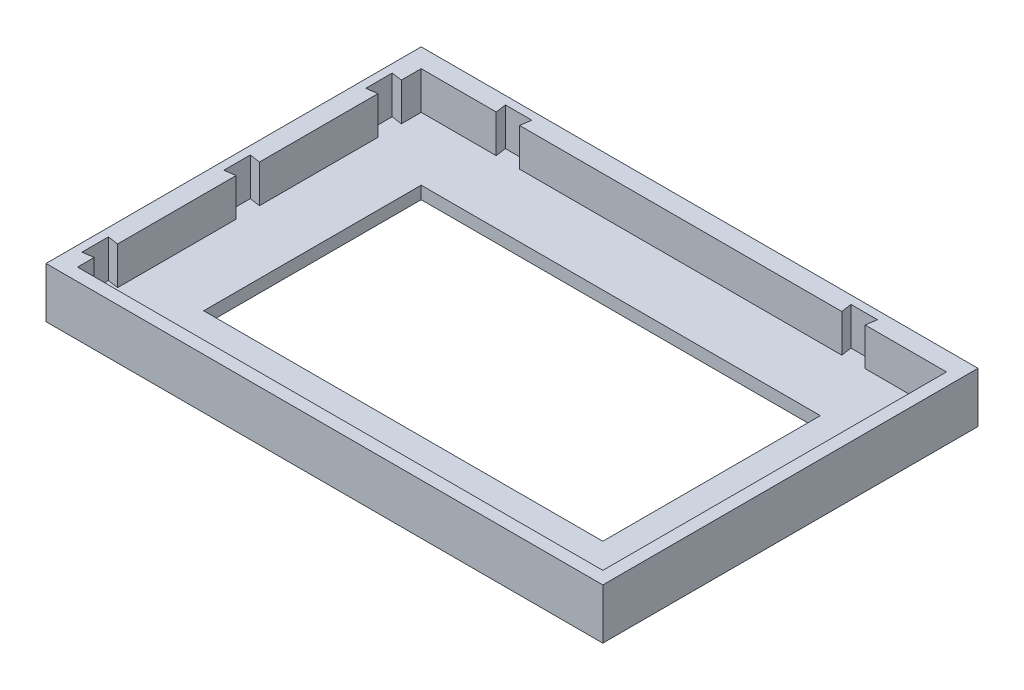
ISO-10303-21;
HEADER;
FILE_DESCRIPTION(('STEP AP214'),'2;1');
FILE_NAME('part.step','',(''),(''),'','','');
FILE_SCHEMA(('AUTOMOTIVE_DESIGN { 1 0 10303 214 1 1 1 1 }'));
ENDSEC;
DATA;
#1=APPLICATION_CONTEXT('core data for automotive mechanical design processes');
#2=APPLICATION_PROTOCOL_DEFINITION('international standard','automotive_design',2000,#1);
#3=PRODUCT_CONTEXT('',#1,'mechanical');
#4=PRODUCT('Part','Part','',(#3));
#5=PRODUCT_RELATED_PRODUCT_CATEGORY('part','',(#4));
#6=PRODUCT_DEFINITION_FORMATION('','',#4);
#7=PRODUCT_DEFINITION_CONTEXT('part definition',#1,'design');
#8=PRODUCT_DEFINITION('design','',#6,#7);
#9=PRODUCT_DEFINITION_SHAPE('','',#8);
#10=(LENGTH_UNIT() NAMED_UNIT(*) SI_UNIT(.MILLI.,.METRE.));
#11=(NAMED_UNIT(*) PLANE_ANGLE_UNIT() SI_UNIT($,.RADIAN.));
#12=(NAMED_UNIT(*) SI_UNIT($,.STERADIAN.) SOLID_ANGLE_UNIT());
#13=UNCERTAINTY_MEASURE_WITH_UNIT(LENGTH_MEASURE(1.E-05),#10,'distance_accuracy_value','');
#14=(GEOMETRIC_REPRESENTATION_CONTEXT(3) GLOBAL_UNCERTAINTY_ASSIGNED_CONTEXT((#13)) GLOBAL_UNIT_ASSIGNED_CONTEXT((#10,
#11,#12)) REPRESENTATION_CONTEXT('',''));
#15=CARTESIAN_POINT('',(0.,0.,0.));
#16=DIRECTION('',(0.,0.,1.));
#17=DIRECTION('',(1.,0.,0.));
#18=AXIS2_PLACEMENT_3D('',#15,#16,#17);
#19=CARTESIAN_POINT('',(-35.2233281216379,-99.5446633426423,-22.4535939570029));
#20=DIRECTION('',(0.,0.,-1.));
#21=DIRECTION('',(-1.,0.,0.));
#22=AXIS2_PLACEMENT_3D('',#19,#20,#21);
#23=PLANE('',#22);
#24=DIRECTION('',(-1.,0.,0.));
#25=VECTOR('',#24,1.);
#26=CARTESIAN_POINT('',(-35.2233281216379,2.,-22.4535939570029));
#27=LINE('',#26,#25);
#28=CARTESIAN_POINT('',(31.4766718783621,2.,-22.4535939570029));
#29=VERTEX_POINT('',#28);
#30=CARTESIAN_POINT('',(-19.6233281216379,2.,-22.4535939570029));
#31=VERTEX_POINT('',#30);
#32=EDGE_CURVE('E520',#29,#31,#27,.T.);
#33=ORIENTED_EDGE('',*,*,#32,.F.);
#34=DIRECTION('',(0.,1.,0.));
#35=VECTOR('',#34,1.);
#36=CARTESIAN_POINT('',(31.4766718783621,-2.53100430368368,-22.4535939570029));
#37=LINE('',#36,#35);
#38=CARTESIAN_POINT('',(31.4766718783621,8.,-22.4535939570029));
#39=VERTEX_POINT('',#38);
#40=EDGE_CURVE('E388',#29,#39,#37,.T.);
#41=ORIENTED_EDGE('',*,*,#40,.T.);
#42=DIRECTION('',(-1.,0.,0.));
#43=VECTOR('',#42,1.);
#44=CARTESIAN_POINT('',(-35.2233281216379,8.,-22.4535939570029));
#45=LINE('',#44,#43);
#46=CARTESIAN_POINT('',(-19.6233281216379,8.,-22.4535939570029));
#47=VERTEX_POINT('',#46);
#48=EDGE_CURVE('E489',#39,#47,#45,.T.);
#49=ORIENTED_EDGE('',*,*,#48,.T.);
#50=DIRECTION('',(0.,1.,0.));
#51=VECTOR('',#50,1.);
#52=CARTESIAN_POINT('',(-19.6233281216379,-2.53100430368368,-22.4535939570029));
#53=LINE('',#52,#51);
#54=EDGE_CURVE('E428',#31,#47,#53,.T.);
#55=ORIENTED_EDGE('',*,*,#54,.F.);
#56=EDGE_LOOP('',(#33,#41,#49,#55));
#57=FACE_BOUND('',#56,.T.);
#58=ADVANCED_FACE('F45',(#57),#23,.F.);
#59=CARTESIAN_POINT('',(-23.3233281216379,2.,-22.4535939570029));
#60=VERTEX_POINT('',#59);
#61=CARTESIAN_POINT('',(-35.2233281216379,2.,-22.4535939570029));
#62=VERTEX_POINT('',#61);
#63=EDGE_CURVE('E521',#60,#62,#27,.T.);
#64=ORIENTED_EDGE('',*,*,#63,.F.);
#65=DIRECTION('',(0.,1.,0.));
#66=VECTOR('',#65,1.);
#67=CARTESIAN_POINT('',(-23.3233281216379,-2.53100430368368,-22.4535939570029));
#68=LINE('',#67,#66);
#69=CARTESIAN_POINT('',(-23.3233281216379,8.,-22.4535939570029));
#70=VERTEX_POINT('',#69);
#71=EDGE_CURVE('E424',#60,#70,#68,.T.);
#72=ORIENTED_EDGE('',*,*,#71,.T.);
#73=CARTESIAN_POINT('',(-35.2233281216379,8.,-22.4535939570029));
#74=VERTEX_POINT('',#73);
#75=EDGE_CURVE('E490',#70,#74,#45,.T.);
#76=ORIENTED_EDGE('',*,*,#75,.T.);
#77=DIRECTION('',(0.,1.,0.));
#78=VECTOR('',#77,1.);
#79=CARTESIAN_POINT('',(-35.2233281216379,-99.5446633426423,-22.4535939570029));
#80=LINE('',#79,#78);
#81=EDGE_CURVE('E519',#62,#74,#80,.T.);
#82=ORIENTED_EDGE('',*,*,#81,.F.);
#83=EDGE_LOOP('',(#64,#72,#76,#82));
#84=FACE_BOUND('',#83,.T.);
#85=ADVANCED_FACE('F599',(#84),#23,.F.);
#86=CARTESIAN_POINT('',(-35.2233281216379,-99.5446633426423,32.0464060429971));
#87=DIRECTION('',(-1.,0.,0.));
#88=DIRECTION('',(0.,0.,1.));
#89=AXIS2_PLACEMENT_3D('',#86,#87,#88);
#90=PLANE('',#89);
#91=DIRECTION('',(0.,0.,1.));
#92=VECTOR('',#91,1.);
#93=CARTESIAN_POINT('',(-35.2233281216379,8.,32.0464060429971));
#94=LINE('',#93,#92);
#95=CARTESIAN_POINT('',(-35.2233281216379,8.,6.8964060429971));
#96=VERTEX_POINT('',#95);
#97=CARTESIAN_POINT('',(-35.2233281216379,8.,25.6964060429971));
#98=VERTEX_POINT('',#97);
#99=EDGE_CURVE('E645',#96,#98,#94,.T.);
#100=ORIENTED_EDGE('',*,*,#99,.T.);
#101=DIRECTION('',(0.,1.,0.));
#102=VECTOR('',#101,1.);
#103=CARTESIAN_POINT('',(-35.2233281216379,-2.53100430368368,25.6964060429971));
#104=LINE('',#103,#102);
#105=CARTESIAN_POINT('',(-35.2233281216379,2.,25.6964060429971));
#106=VERTEX_POINT('',#105);
#107=EDGE_CURVE('E334',#106,#98,#104,.T.);
#108=ORIENTED_EDGE('',*,*,#107,.F.);
#109=DIRECTION('',(0.,0.,1.));
#110=VECTOR('',#109,1.);
#111=CARTESIAN_POINT('',(-35.2233281216379,2.,32.0464060429971));
#112=LINE('',#111,#110);
#113=CARTESIAN_POINT('',(-35.223328121638,2.,6.89640604299711));
#114=VERTEX_POINT('',#113);
#115=EDGE_CURVE('E666',#114,#106,#112,.T.);
#116=ORIENTED_EDGE('',*,*,#115,.F.);
#117=DIRECTION('',(0.,1.,0.));
#118=VECTOR('',#117,1.);
#119=CARTESIAN_POINT('',(-35.223328121638,-2.53100430368368,6.89640604299711));
#120=LINE('',#119,#118);
#121=EDGE_CURVE('E452',#114,#96,#120,.T.);
#122=ORIENTED_EDGE('',*,*,#121,.T.);
#123=EDGE_LOOP('',(#100,#108,#116,#122));
#124=FACE_BOUND('',#123,.T.);
#125=ADVANCED_FACE('F606',(#124),#90,.F.);
#126=CARTESIAN_POINT('',(-35.2233281216381,8.,-19.3035939570029));
#127=VERTEX_POINT('',#126);
#128=EDGE_CURVE('E499',#74,#127,#94,.T.);
#129=ORIENTED_EDGE('',*,*,#128,.T.);
#130=DIRECTION('',(0.,1.,0.));
#131=VECTOR('',#130,1.);
#132=CARTESIAN_POINT('',(-35.2233281216381,-2.53100430368368,-19.3035939570029));
#133=LINE('',#132,#131);
#134=CARTESIAN_POINT('',(-35.2233281216381,2.,-19.3035939570029));
#135=VERTEX_POINT('',#134);
#136=EDGE_CURVE('E342',#135,#127,#133,.T.);
#137=ORIENTED_EDGE('',*,*,#136,.F.);
#138=EDGE_CURVE('E508',#62,#135,#112,.T.);
#139=ORIENTED_EDGE('',*,*,#138,.F.);
#140=ORIENTED_EDGE('',*,*,#81,.T.);
#141=EDGE_LOOP('',(#129,#137,#139,#140));
#142=FACE_BOUND('',#141,.T.);
#143=ADVANCED_FACE('F926',(#142),#90,.F.);
#144=CARTESIAN_POINT('',(-35.2233281216381,2.,-15.6035939570029));
#145=VERTEX_POINT('',#144);
#146=CARTESIAN_POINT('',(-35.223328121638,2.,3.1964060429971));
#147=VERTEX_POINT('',#146);
#148=EDGE_CURVE('E513',#145,#147,#112,.T.);
#149=ORIENTED_EDGE('',*,*,#148,.F.);
#150=DIRECTION('',(0.,1.,0.));
#151=VECTOR('',#150,1.);
#152=CARTESIAN_POINT('',(-35.2233281216381,-2.53100430368368,-15.6035939570029));
#153=LINE('',#152,#151);
#154=CARTESIAN_POINT('',(-35.2233281216379,8.,-15.6035939570029));
#155=VERTEX_POINT('',#154);
#156=EDGE_CURVE('E345',#145,#155,#153,.T.);
#157=ORIENTED_EDGE('',*,*,#156,.T.);
#158=CARTESIAN_POINT('',(-35.223328121638,8.,3.1964060429971));
#159=VERTEX_POINT('',#158);
#160=EDGE_CURVE('E503',#155,#159,#94,.T.);
#161=ORIENTED_EDGE('',*,*,#160,.T.);
#162=DIRECTION('',(0.,1.,0.));
#163=VECTOR('',#162,1.);
#164=CARTESIAN_POINT('',(-35.223328121638,-2.53100430368368,3.1964060429971));
#165=LINE('',#164,#163);
#166=EDGE_CURVE('E373',#147,#159,#165,.T.);
#167=ORIENTED_EDGE('',*,*,#166,.F.);
#168=EDGE_LOOP('',(#149,#157,#161,#167));
#169=FACE_BOUND('',#168,.T.);
#170=ADVANCED_FACE('F597',(#169),#90,.F.);
#171=CARTESIAN_POINT('',(-38.2233281216379,8.,34.0464060429971));
#172=DIRECTION('',(1.,0.,0.));
#173=DIRECTION('',(0.,0.,-1.));
#174=AXIS2_PLACEMENT_3D('',#171,#172,#173);
#175=PLANE('',#174);
#176=DIRECTION('',(0.,0.,1.));
#177=VECTOR('',#176,1.);
#178=CARTESIAN_POINT('',(-38.2233281216379,0.,34.0464060429971));
#179=LINE('',#178,#177);
#180=CARTESIAN_POINT('',(-38.2233281216379,0.,-25.4535939570029));
#181=VERTEX_POINT('',#180);
#182=CARTESIAN_POINT('',(-38.2233281216379,0.,34.0464060429971));
#183=VERTEX_POINT('',#182);
#184=EDGE_CURVE('E537',#181,#183,#179,.T.);
#185=ORIENTED_EDGE('',*,*,#184,.T.);
#186=DIRECTION('',(0.,-1.,0.));
#187=VECTOR('',#186,1.);
#188=CARTESIAN_POINT('',(-38.2233281216379,8.,34.0464060429971));
#189=LINE('',#188,#187);
#190=CARTESIAN_POINT('',(-38.2233281216379,8.,34.0464060429971));
#191=VERTEX_POINT('',#190);
#192=EDGE_CURVE('E12',#191,#183,#189,.T.);
#193=ORIENTED_EDGE('',*,*,#192,.F.);
#194=DIRECTION('',(0.,0.,1.));
#195=VECTOR('',#194,1.);
#196=CARTESIAN_POINT('',(-38.2233281216379,8.,34.0464060429971));
#197=LINE('',#196,#195);
#198=CARTESIAN_POINT('',(-38.2233281216379,8.,-25.4535939570029));
#199=VERTEX_POINT('',#198);
#200=EDGE_CURVE('E538',#199,#191,#197,.T.);
#201=ORIENTED_EDGE('',*,*,#200,.F.);
#202=DIRECTION('',(0.,-1.,0.));
#203=VECTOR('',#202,1.);
#204=CARTESIAN_POINT('',(-38.2233281216379,8.,-25.4535939570029));
#205=LINE('',#204,#203);
#206=EDGE_CURVE('E552',#199,#181,#205,.T.);
#207=ORIENTED_EDGE('',*,*,#206,.T.);
#208=EDGE_LOOP('',(#185,#193,#201,#207));
#209=FACE_BOUND('',#208,.T.);
#210=ADVANCED_FACE('F47',(#209),#175,.F.);
#211=CARTESIAN_POINT('',(-38.2233281216379,8.,34.0464060429971));
#212=DIRECTION('',(0.,0.,-1.));
#213=DIRECTION('',(-1.,0.,0.));
#214=AXIS2_PLACEMENT_3D('',#211,#212,#213);
#215=PLANE('',#214);
#216=DIRECTION('',(1.,0.,0.));
#217=VECTOR('',#216,1.);
#218=CARTESIAN_POINT('',(-38.2233281216379,0.,34.0464060429971));
#219=LINE('',#218,#217);
#220=CARTESIAN_POINT('',(50.0766718783621,0.,34.0464060429971));
#221=VERTEX_POINT('',#220);
#222=EDGE_CURVE('E556',#183,#221,#219,.T.);
#223=ORIENTED_EDGE('',*,*,#222,.T.);
#224=DIRECTION('',(0.,-1.,0.));
#225=VECTOR('',#224,1.);
#226=CARTESIAN_POINT('',(50.0766718783621,8.,34.0464060429971));
#227=LINE('',#226,#225);
#228=CARTESIAN_POINT('',(50.0766718783621,8.,34.0464060429971));
#229=VERTEX_POINT('',#228);
#230=EDGE_CURVE('E54',#229,#221,#227,.T.);
#231=ORIENTED_EDGE('',*,*,#230,.F.);
#232=DIRECTION('',(1.,0.,0.));
#233=VECTOR('',#232,1.);
#234=CARTESIAN_POINT('',(-38.2233281216379,8.,34.0464060429971));
#235=LINE('',#234,#233);
#236=EDGE_CURVE('E542',#191,#229,#235,.T.);
#237=ORIENTED_EDGE('',*,*,#236,.F.);
#238=ORIENTED_EDGE('',*,*,#192,.T.);
#239=EDGE_LOOP('',(#223,#231,#237,#238));
#240=FACE_BOUND('',#239,.T.);
#241=ADVANCED_FACE('F590',(#240),#215,.F.);
#242=CARTESIAN_POINT('',(50.0766718783621,8.,34.0464060429971));
#243=DIRECTION('',(-1.,0.,0.));
#244=DIRECTION('',(0.,0.,1.));
#245=AXIS2_PLACEMENT_3D('',#242,#243,#244);
#246=PLANE('',#245);
#247=DIRECTION('',(0.,0.,-1.));
#248=VECTOR('',#247,1.);
#249=CARTESIAN_POINT('',(50.0766718783621,0.,34.0464060429971));
#250=LINE('',#249,#248);
#251=CARTESIAN_POINT('',(50.0766718783621,0.,-25.4535939570029));
#252=VERTEX_POINT('',#251);
#253=EDGE_CURVE('E559',#221,#252,#250,.T.);
#254=ORIENTED_EDGE('',*,*,#253,.T.);
#255=DIRECTION('',(0.,-1.,0.));
#256=VECTOR('',#255,1.);
#257=CARTESIAN_POINT('',(50.0766718783621,8.,-25.4535939570029));
#258=LINE('',#257,#256);
#259=CARTESIAN_POINT('',(50.0766718783621,8.,-25.4535939570029));
#260=VERTEX_POINT('',#259);
#261=EDGE_CURVE('E567',#260,#252,#258,.T.);
#262=ORIENTED_EDGE('',*,*,#261,.F.);
#263=DIRECTION('',(0.,0.,-1.));
#264=VECTOR('',#263,1.);
#265=CARTESIAN_POINT('',(50.0766718783621,8.,34.0464060429971));
#266=LINE('',#265,#264);
#267=EDGE_CURVE('E546',#229,#260,#266,.T.);
#268=ORIENTED_EDGE('',*,*,#267,.F.);
#269=ORIENTED_EDGE('',*,*,#230,.T.);
#270=EDGE_LOOP('',(#254,#262,#268,#269));
#271=FACE_BOUND('',#270,.T.);
#272=ADVANCED_FACE('F576',(#271),#246,.F.);
#273=CARTESIAN_POINT('',(-38.2233281216379,8.,-25.4535939570029));
#274=DIRECTION('',(0.,0.,1.));
#275=DIRECTION('',(1.,0.,0.));
#276=AXIS2_PLACEMENT_3D('',#273,#274,#275);
#277=PLANE('',#276);
#278=DIRECTION('',(-1.,0.,0.));
#279=VECTOR('',#278,1.);
#280=CARTESIAN_POINT('',(-38.2233281216379,0.,-25.4535939570029));
#281=LINE('',#280,#279);
#282=EDGE_CURVE('E543',#252,#181,#281,.T.);
#283=ORIENTED_EDGE('',*,*,#282,.T.);
#284=ORIENTED_EDGE('',*,*,#206,.F.);
#285=DIRECTION('',(-1.,0.,0.));
#286=VECTOR('',#285,1.);
#287=CARTESIAN_POINT('',(-38.2233281216379,8.,-25.4535939570029));
#288=LINE('',#287,#286);
#289=EDGE_CURVE('E549',#260,#199,#288,.T.);
#290=ORIENTED_EDGE('',*,*,#289,.F.);
#291=ORIENTED_EDGE('',*,*,#261,.T.);
#292=EDGE_LOOP('',(#283,#284,#290,#291));
#293=FACE_BOUND('',#292,.T.);
#294=ADVANCED_FACE('F583',(#293),#277,.F.);
#295=CARTESIAN_POINT('',(0.,8.,0.));
#296=DIRECTION('',(0.,-1.,0.));
#297=DIRECTION('',(0.,0.,-1.));
#298=AXIS2_PLACEMENT_3D('',#295,#296,#297);
#299=PLANE('',#298);
#300=DIRECTION('',(0.,0.,1.));
#301=VECTOR('',#300,1.);
#302=CARTESIAN_POINT('',(-36.9233281216379,8.,29.6464060429971));
#303=LINE('',#302,#301);
#304=CARTESIAN_POINT('',(-36.9233281216379,8.,25.4464060429971));
#305=VERTEX_POINT('',#304);
#306=CARTESIAN_POINT('',(-36.9233281216379,8.,29.6464060429971));
#307=VERTEX_POINT('',#306);
#308=EDGE_CURVE('E308',#305,#307,#303,.T.);
#309=ORIENTED_EDGE('',*,*,#308,.F.);
#310=DIRECTION('',(-0.989359135364853,0.,-0.145493990494831));
#311=VECTOR('',#310,1.);
#312=CARTESIAN_POINT('',(-36.9233281216379,8.,25.4464060429971));
#313=LINE('',#312,#311);
#314=EDGE_CURVE('E312',#98,#305,#313,.T.);
#315=ORIENTED_EDGE('',*,*,#314,.F.);
#316=ORIENTED_EDGE('',*,*,#99,.F.);
#317=DIRECTION('',(0.989359135364853,0.,-0.145493990494831));
#318=VECTOR('',#317,1.);
#319=CARTESIAN_POINT('',(-35.223328121638,8.,6.89640604299711));
#320=LINE('',#319,#318);
#321=CARTESIAN_POINT('',(-36.923328121638,8.,7.14640604299711));
#322=VERTEX_POINT('',#321);
#323=EDGE_CURVE('E474',#322,#96,#320,.T.);
#324=ORIENTED_EDGE('',*,*,#323,.F.);
#325=DIRECTION('',(0.,0.,1.));
#326=VECTOR('',#325,1.);
#327=CARTESIAN_POINT('',(-36.923328121638,8.,7.14640604299711));
#328=LINE('',#327,#326);
#329=CARTESIAN_POINT('',(-36.923328121638,8.,2.9464060429971));
#330=VERTEX_POINT('',#329);
#331=EDGE_CURVE('E478',#330,#322,#328,.T.);
#332=ORIENTED_EDGE('',*,*,#331,.F.);
#333=DIRECTION('',(-0.989359135364853,0.,-0.145493990494831));
#334=VECTOR('',#333,1.);
#335=CARTESIAN_POINT('',(-36.923328121638,8.,2.9464060429971));
#336=LINE('',#335,#334);
#337=EDGE_CURVE('E418',#159,#330,#336,.T.);
#338=ORIENTED_EDGE('',*,*,#337,.F.);
#339=ORIENTED_EDGE('',*,*,#160,.F.);
#340=DIRECTION('',(0.989359135364853,0.,-0.145493990494831));
#341=VECTOR('',#340,1.);
#342=CARTESIAN_POINT('',(-35.2233281216381,8.,-15.6035939570029));
#343=LINE('',#342,#341);
#344=CARTESIAN_POINT('',(-36.9233281216381,8.,-15.3535939570029));
#345=VERTEX_POINT('',#344);
#346=EDGE_CURVE('E368',#345,#155,#343,.T.);
#347=ORIENTED_EDGE('',*,*,#346,.F.);
#348=DIRECTION('',(0.,0.,1.));
#349=VECTOR('',#348,1.);
#350=CARTESIAN_POINT('',(-36.9233281216381,8.,-15.3535939570029));
#351=LINE('',#350,#349);
#352=CARTESIAN_POINT('',(-36.9233281216381,8.,-19.5535939570029));
#353=VERTEX_POINT('',#352);
#354=EDGE_CURVE('E374',#353,#345,#351,.T.);
#355=ORIENTED_EDGE('',*,*,#354,.F.);
#356=DIRECTION('',(-0.989359135364853,0.,-0.145493990494831));
#357=VECTOR('',#356,1.);
#358=CARTESIAN_POINT('',(-36.9233281216381,8.,-19.5535939570029));
#359=LINE('',#358,#357);
#360=EDGE_CURVE('E369',#127,#353,#359,.T.);
#361=ORIENTED_EDGE('',*,*,#360,.F.);
#362=ORIENTED_EDGE('',*,*,#128,.F.);
#363=ORIENTED_EDGE('',*,*,#75,.F.);
#364=DIRECTION('',(0.145493990494831,0.,0.989359135364853));
#365=VECTOR('',#364,1.);
#366=CARTESIAN_POINT('',(-23.3233281216379,8.,-22.4535939570029));
#367=LINE('',#366,#365);
#368=CARTESIAN_POINT('',(-23.5733281216379,8.,-24.1535939570029));
#369=VERTEX_POINT('',#368);
#370=EDGE_CURVE('E440',#369,#70,#367,.T.);
#371=ORIENTED_EDGE('',*,*,#370,.F.);
#372=DIRECTION('',(-1.,0.,0.));
#373=VECTOR('',#372,1.);
#374=CARTESIAN_POINT('',(-23.5733281216379,8.,-24.1535939570029));
#375=LINE('',#374,#373);
#376=CARTESIAN_POINT('',(-19.3733281216379,8.,-24.1535939570029));
#377=VERTEX_POINT('',#376);
#378=EDGE_CURVE('E444',#377,#369,#375,.T.);
#379=ORIENTED_EDGE('',*,*,#378,.F.);
#380=DIRECTION('',(0.145493990494831,0.,-0.989359135364853));
#381=VECTOR('',#380,1.);
#382=CARTESIAN_POINT('',(-19.3733281216379,8.,-24.1535939570029));
#383=LINE('',#382,#381);
#384=EDGE_CURVE('E316',#47,#377,#383,.T.);
#385=ORIENTED_EDGE('',*,*,#384,.F.);
#386=ORIENTED_EDGE('',*,*,#48,.F.);
#387=DIRECTION('',(0.145493990494833,0.,0.989359135364853));
#388=VECTOR('',#387,1.);
#389=CARTESIAN_POINT('',(31.4766718783621,8.,-22.4535939570029));
#390=LINE('',#389,#388);
#391=CARTESIAN_POINT('',(31.2266718783621,8.,-24.1535939570029));
#392=VERTEX_POINT('',#391);
#393=EDGE_CURVE('E404',#392,#39,#390,.T.);
#394=ORIENTED_EDGE('',*,*,#393,.F.);
#395=DIRECTION('',(-1.,0.,0.));
#396=VECTOR('',#395,1.);
#397=CARTESIAN_POINT('',(31.2266718783621,8.,-24.1535939570029));
#398=LINE('',#397,#396);
#399=CARTESIAN_POINT('',(35.4266718783621,8.,-24.1535939570029));
#400=VERTEX_POINT('',#399);
#401=EDGE_CURVE('E408',#400,#392,#398,.T.);
#402=ORIENTED_EDGE('',*,*,#401,.F.);
#403=DIRECTION('',(0.145493990494831,0.,-0.989359135364853));
#404=VECTOR('',#403,1.);
#405=CARTESIAN_POINT('',(35.4266718783621,8.,-24.1535939570029));
#406=LINE('',#405,#404);
#407=CARTESIAN_POINT('',(35.1766718783621,8.,-22.4535939570029));
#408=VERTEX_POINT('',#407);
#409=EDGE_CURVE('E346',#408,#400,#406,.T.);
#410=ORIENTED_EDGE('',*,*,#409,.F.);
#411=CARTESIAN_POINT('',(48.0766718783621,8.,-22.4535939570029));
#412=VERTEX_POINT('',#411);
#413=EDGE_CURVE('E484',#412,#408,#45,.T.);
#414=ORIENTED_EDGE('',*,*,#413,.F.);
#415=DIRECTION('',(0.,0.,-1.));
#416=VECTOR('',#415,1.);
#417=CARTESIAN_POINT('',(48.0766718783621,8.,32.0464060429971));
#418=LINE('',#417,#416);
#419=CARTESIAN_POINT('',(48.0766718783621,8.,32.0464060429971));
#420=VERTEX_POINT('',#419);
#421=EDGE_CURVE('E491',#420,#412,#418,.T.);
#422=ORIENTED_EDGE('',*,*,#421,.F.);
#423=DIRECTION('',(1.,0.,0.));
#424=VECTOR('',#423,1.);
#425=CARTESIAN_POINT('',(-35.2233281216379,8.,32.0464060429971));
#426=LINE('',#425,#424);
#427=CARTESIAN_POINT('',(-35.2233281216379,8.,32.0464060429971));
#428=VERTEX_POINT('',#427);
#429=EDGE_CURVE('E495',#428,#420,#426,.T.);
#430=ORIENTED_EDGE('',*,*,#429,.F.);
#431=CARTESIAN_POINT('',(-35.2233281216379,8.,29.3964060429971));
#432=VERTEX_POINT('',#431);
#433=EDGE_CURVE('E341',#432,#428,#94,.T.);
#434=ORIENTED_EDGE('',*,*,#433,.F.);
#435=DIRECTION('',(0.989359135364853,0.,-0.145493990494831));
#436=VECTOR('',#435,1.);
#437=CARTESIAN_POINT('',(-35.2233281216379,8.,29.3964060429971));
#438=LINE('',#437,#436);
#439=EDGE_CURVE('E304',#307,#432,#438,.T.);
#440=ORIENTED_EDGE('',*,*,#439,.F.);
#441=EDGE_LOOP('',(#309,#315,#316,#324,#332,#338,#339,#347,#355,#361,#362,#363,#371,#379,#385,
#386,#394,#402,#410,#414,#422,#430,#434,#440));
#442=FACE_BOUND('',#441,.T.);
#443=ORIENTED_EDGE('',*,*,#200,.T.);
#444=ORIENTED_EDGE('',*,*,#236,.T.);
#445=ORIENTED_EDGE('',*,*,#267,.T.);
#446=ORIENTED_EDGE('',*,*,#289,.T.);
#447=EDGE_LOOP('',(#443,#444,#445,#446));
#448=FACE_BOUND('',#447,.T.);
#449=ADVANCED_FACE('F589',(#442,#448),#299,.F.);
#450=CARTESIAN_POINT('',(0.,0.,0.));
#451=DIRECTION('',(0.,-1.,0.));
#452=DIRECTION('',(0.,0.,-1.));
#453=AXIS2_PLACEMENT_3D('',#450,#451,#452);
#454=PLANE('',#453);
#455=DIRECTION('',(0.,0.,1.));
#456=VECTOR('',#455,1.);
#457=CARTESIAN_POINT('',(-25.2233281216381,0.,22.0464060429971));
#458=LINE('',#457,#456);
#459=CARTESIAN_POINT('',(-25.2233281216381,0.,-12.4535939570029));
#460=VERTEX_POINT('',#459);
#461=CARTESIAN_POINT('',(-25.2233281216381,0.,22.0464060429971));
#462=VERTEX_POINT('',#461);
#463=EDGE_CURVE('E257',#460,#462,#458,.T.);
#464=ORIENTED_EDGE('',*,*,#463,.T.);
#465=DIRECTION('',(1.,0.,0.));
#466=VECTOR('',#465,1.);
#467=CARTESIAN_POINT('',(-25.2233281216381,0.,22.0464060429971));
#468=LINE('',#467,#466);
#469=CARTESIAN_POINT('',(38.0766718783621,0.,22.0464060429971));
#470=VERTEX_POINT('',#469);
#471=EDGE_CURVE('E267',#462,#470,#468,.T.);
#472=ORIENTED_EDGE('',*,*,#471,.T.);
#473=DIRECTION('',(0.,0.,-1.));
#474=VECTOR('',#473,1.);
#475=CARTESIAN_POINT('',(38.0766718783621,0.,22.0464060429971));
#476=LINE('',#475,#474);
#477=CARTESIAN_POINT('',(38.0766718783621,0.,-12.4535939570029));
#478=VERTEX_POINT('',#477);
#479=EDGE_CURVE('E61',#470,#478,#476,.T.);
#480=ORIENTED_EDGE('',*,*,#479,.T.);
#481=DIRECTION('',(-1.,0.,0.));
#482=VECTOR('',#481,1.);
#483=CARTESIAN_POINT('',(-25.2233281216381,0.,-12.4535939570029));
#484=LINE('',#483,#482);
#485=EDGE_CURVE('E264',#478,#460,#484,.T.);
#486=ORIENTED_EDGE('',*,*,#485,.T.);
#487=EDGE_LOOP('',(#464,#472,#480,#486));
#488=FACE_BOUND('',#487,.T.);
#489=ORIENTED_EDGE('',*,*,#184,.F.);
#490=ORIENTED_EDGE('',*,*,#282,.F.);
#491=ORIENTED_EDGE('',*,*,#253,.F.);
#492=ORIENTED_EDGE('',*,*,#222,.F.);
#493=EDGE_LOOP('',(#489,#490,#491,#492));
#494=FACE_BOUND('',#493,.T.);
#495=ADVANCED_FACE('F272',(#488,#494),#454,.T.);
#496=CARTESIAN_POINT('',(0.,2.,0.));
#497=DIRECTION('',(0.,-1.,0.));
#498=DIRECTION('',(0.,0.,-1.));
#499=AXIS2_PLACEMENT_3D('',#496,#497,#498);
#500=PLANE('',#499);
#501=DIRECTION('',(1.,0.,0.));
#502=VECTOR('',#501,1.);
#503=CARTESIAN_POINT('',(-25.2233281216381,2.,22.0464060429971));
#504=LINE('',#503,#502);
#505=CARTESIAN_POINT('',(-25.2233281216381,2.,22.0464060429971));
#506=VERTEX_POINT('',#505);
#507=CARTESIAN_POINT('',(38.0766718783621,2.,22.0464060429971));
#508=VERTEX_POINT('',#507);
#509=EDGE_CURVE('E289',#506,#508,#504,.T.);
#510=ORIENTED_EDGE('',*,*,#509,.F.);
#511=DIRECTION('',(0.,0.,1.));
#512=VECTOR('',#511,1.);
#513=CARTESIAN_POINT('',(-25.2233281216381,2.,22.0464060429971));
#514=LINE('',#513,#512);
#515=CARTESIAN_POINT('',(-25.2233281216381,2.,-12.4535939570029));
#516=VERTEX_POINT('',#515);
#517=EDGE_CURVE('E69',#516,#506,#514,.T.);
#518=ORIENTED_EDGE('',*,*,#517,.F.);
#519=DIRECTION('',(-1.,0.,0.));
#520=VECTOR('',#519,1.);
#521=CARTESIAN_POINT('',(-25.2233281216381,2.,-12.4535939570029));
#522=LINE('',#521,#520);
#523=CARTESIAN_POINT('',(38.0766718783621,2.,-12.4535939570029));
#524=VERTEX_POINT('',#523);
#525=EDGE_CURVE('E276',#524,#516,#522,.T.);
#526=ORIENTED_EDGE('',*,*,#525,.F.);
#527=DIRECTION('',(0.,0.,-1.));
#528=VECTOR('',#527,1.);
#529=CARTESIAN_POINT('',(38.0766718783621,2.,22.0464060429971));
#530=LINE('',#529,#528);
#531=EDGE_CURVE('E280',#508,#524,#530,.T.);
#532=ORIENTED_EDGE('',*,*,#531,.F.);
#533=EDGE_LOOP('',(#510,#518,#526,#532));
#534=FACE_BOUND('',#533,.T.);
#535=ORIENTED_EDGE('',*,*,#138,.T.);
#536=DIRECTION('',(-0.989359135364853,0.,-0.145493990494831));
#537=VECTOR('',#536,1.);
#538=CARTESIAN_POINT('',(-36.9233281216381,2.,-19.5535939570029));
#539=LINE('',#538,#537);
#540=CARTESIAN_POINT('',(-36.9233281216381,2.,-19.5535939570029));
#541=VERTEX_POINT('',#540);
#542=EDGE_CURVE('E350',#135,#541,#539,.T.);
#543=ORIENTED_EDGE('',*,*,#542,.T.);
#544=DIRECTION('',(0.,0.,1.));
#545=VECTOR('',#544,1.);
#546=CARTESIAN_POINT('',(-36.9233281216381,2.,-15.3535939570029));
#547=LINE('',#546,#545);
#548=CARTESIAN_POINT('',(-36.9233281216381,2.,-15.3535939570029));
#549=VERTEX_POINT('',#548);
#550=EDGE_CURVE('E351',#541,#549,#547,.T.);
#551=ORIENTED_EDGE('',*,*,#550,.T.);
#552=DIRECTION('',(0.989359135364853,0.,-0.145493990494831));
#553=VECTOR('',#552,1.);
#554=CARTESIAN_POINT('',(-35.2233281216381,2.,-15.6035939570029));
#555=LINE('',#554,#553);
#556=EDGE_CURVE('E355',#549,#145,#555,.T.);
#557=ORIENTED_EDGE('',*,*,#556,.T.);
#558=ORIENTED_EDGE('',*,*,#148,.T.);
#559=DIRECTION('',(-0.989359135364853,0.,-0.145493990494831));
#560=VECTOR('',#559,1.);
#561=CARTESIAN_POINT('',(-36.923328121638,2.,2.9464060429971));
#562=LINE('',#561,#560);
#563=CARTESIAN_POINT('',(-36.923328121638,2.,2.9464060429971));
#564=VERTEX_POINT('',#563);
#565=EDGE_CURVE('E456',#147,#564,#562,.T.);
#566=ORIENTED_EDGE('',*,*,#565,.T.);
#567=DIRECTION('',(0.,0.,1.));
#568=VECTOR('',#567,1.);
#569=CARTESIAN_POINT('',(-36.923328121638,2.,7.14640604299711));
#570=LINE('',#569,#568);
#571=CARTESIAN_POINT('',(-36.923328121638,2.,7.14640604299711));
#572=VERTEX_POINT('',#571);
#573=EDGE_CURVE('E457',#564,#572,#570,.T.);
#574=ORIENTED_EDGE('',*,*,#573,.T.);
#575=DIRECTION('',(0.989359135364853,0.,-0.145493990494831));
#576=VECTOR('',#575,1.);
#577=CARTESIAN_POINT('',(-35.223328121638,2.,6.89640604299711));
#578=LINE('',#577,#576);
#579=EDGE_CURVE('E461',#572,#114,#578,.T.);
#580=ORIENTED_EDGE('',*,*,#579,.T.);
#581=ORIENTED_EDGE('',*,*,#115,.T.);
#582=DIRECTION('',(-0.989359135364853,0.,-0.145493990494831));
#583=VECTOR('',#582,1.);
#584=CARTESIAN_POINT('',(-36.9233281216379,2.,25.4464060429971));
#585=LINE('',#584,#583);
#586=CARTESIAN_POINT('',(-36.9233281216379,2.,25.4464060429971));
#587=VERTEX_POINT('',#586);
#588=EDGE_CURVE('E307',#106,#587,#585,.T.);
#589=ORIENTED_EDGE('',*,*,#588,.T.);
#590=DIRECTION('',(0.,0.,1.));
#591=VECTOR('',#590,1.);
#592=CARTESIAN_POINT('',(-36.9233281216379,2.,29.6464060429971));
#593=LINE('',#592,#591);
#594=CARTESIAN_POINT('',(-36.9233281216379,2.,29.6464060429971));
#595=VERTEX_POINT('',#594);
#596=EDGE_CURVE('E327',#587,#595,#593,.T.);
#597=ORIENTED_EDGE('',*,*,#596,.T.);
#598=DIRECTION('',(0.989359135364853,0.,-0.145493990494831));
#599=VECTOR('',#598,1.);
#600=CARTESIAN_POINT('',(-35.2233281216379,2.,29.3964060429971));
#601=LINE('',#600,#599);
#602=CARTESIAN_POINT('',(-35.2233281216379,2.,29.3964060429971));
#603=VERTEX_POINT('',#602);
#604=EDGE_CURVE('E321',#595,#603,#601,.T.);
#605=ORIENTED_EDGE('',*,*,#604,.T.);
#606=CARTESIAN_POINT('',(-35.2233281216379,2.,32.0464060429971));
#607=VERTEX_POINT('',#606);
#608=EDGE_CURVE('E514',#603,#607,#112,.T.);
#609=ORIENTED_EDGE('',*,*,#608,.T.);
#610=DIRECTION('',(1.,0.,0.));
#611=VECTOR('',#610,1.);
#612=CARTESIAN_POINT('',(-35.2233281216379,2.,32.0464060429971));
#613=LINE('',#612,#611);
#614=CARTESIAN_POINT('',(48.0766718783621,2.,32.0464060429971));
#615=VERTEX_POINT('',#614);
#616=EDGE_CURVE('E488',#607,#615,#613,.T.);
#617=ORIENTED_EDGE('',*,*,#616,.T.);
#618=DIRECTION('',(0.,0.,-1.));
#619=VECTOR('',#618,1.);
#620=CARTESIAN_POINT('',(48.0766718783621,2.,32.0464060429971));
#621=LINE('',#620,#619);
#622=CARTESIAN_POINT('',(48.0766718783621,2.,-22.4535939570029));
#623=VERTEX_POINT('',#622);
#624=EDGE_CURVE('E522',#615,#623,#621,.T.);
#625=ORIENTED_EDGE('',*,*,#624,.T.);
#626=CARTESIAN_POINT('',(35.1766718783621,2.,-22.4535939570029));
#627=VERTEX_POINT('',#626);
#628=EDGE_CURVE('E515',#623,#627,#27,.T.);
#629=ORIENTED_EDGE('',*,*,#628,.T.);
#630=DIRECTION('',(0.145493990494831,0.,-0.989359135364853));
#631=VECTOR('',#630,1.);
#632=CARTESIAN_POINT('',(35.4266718783621,2.,-24.1535939570029));
#633=LINE('',#632,#631);
#634=CARTESIAN_POINT('',(35.4266718783621,2.,-24.1535939570029));
#635=VERTEX_POINT('',#634);
#636=EDGE_CURVE('E382',#627,#635,#633,.T.);
#637=ORIENTED_EDGE('',*,*,#636,.T.);
#638=DIRECTION('',(-1.,0.,0.));
#639=VECTOR('',#638,1.);
#640=CARTESIAN_POINT('',(31.2266718783621,2.,-24.1535939570029));
#641=LINE('',#640,#639);
#642=CARTESIAN_POINT('',(31.2266718783621,2.,-24.1535939570029));
#643=VERTEX_POINT('',#642);
#644=EDGE_CURVE('E386',#635,#643,#641,.T.);
#645=ORIENTED_EDGE('',*,*,#644,.T.);
#646=DIRECTION('',(0.145493990494833,0.,0.989359135364853));
#647=VECTOR('',#646,1.);
#648=CARTESIAN_POINT('',(31.4766718783621,2.,-22.4535939570029));
#649=LINE('',#648,#647);
#650=EDGE_CURVE('E387',#643,#29,#649,.T.);
#651=ORIENTED_EDGE('',*,*,#650,.T.);
#652=ORIENTED_EDGE('',*,*,#32,.T.);
#653=DIRECTION('',(0.145493990494831,0.,-0.989359135364853));
#654=VECTOR('',#653,1.);
#655=CARTESIAN_POINT('',(-19.3733281216379,2.,-24.1535939570029));
#656=LINE('',#655,#654);
#657=CARTESIAN_POINT('',(-19.3733281216379,2.,-24.1535939570029));
#658=VERTEX_POINT('',#657);
#659=EDGE_CURVE('E417',#31,#658,#656,.T.);
#660=ORIENTED_EDGE('',*,*,#659,.T.);
#661=DIRECTION('',(-1.,0.,0.));
#662=VECTOR('',#661,1.);
#663=CARTESIAN_POINT('',(-23.5733281216379,2.,-24.1535939570029));
#664=LINE('',#663,#662);
#665=CARTESIAN_POINT('',(-23.5733281216379,2.,-24.1535939570029));
#666=VERTEX_POINT('',#665);
#667=EDGE_CURVE('E422',#658,#666,#664,.T.);
#668=ORIENTED_EDGE('',*,*,#667,.T.);
#669=DIRECTION('',(0.145493990494831,0.,0.989359135364853));
#670=VECTOR('',#669,1.);
#671=CARTESIAN_POINT('',(-23.3233281216379,2.,-22.4535939570029));
#672=LINE('',#671,#670);
#673=EDGE_CURVE('E423',#666,#60,#672,.T.);
#674=ORIENTED_EDGE('',*,*,#673,.T.);
#675=ORIENTED_EDGE('',*,*,#63,.T.);
#676=EDGE_LOOP('',(#535,#543,#551,#557,#558,#566,#574,#580,#581,#589,#597,#605,#609,#617,#625,
#629,#637,#645,#651,#652,#660,#668,#674,#675));
#677=FACE_BOUND('',#676,.T.);
#678=ADVANCED_FACE('F637',(#534,#677),#500,.F.);
#679=CARTESIAN_POINT('',(-35.2233281216379,-99.5446633426423,32.0464060429971));
#680=DIRECTION('',(0.,0.,1.));
#681=DIRECTION('',(1.,0.,0.));
#682=AXIS2_PLACEMENT_3D('',#679,#680,#681);
#683=PLANE('',#682);
#684=DIRECTION('',(0.,1.,0.));
#685=VECTOR('',#684,1.);
#686=CARTESIAN_POINT('',(-35.2233281216379,-99.5446633426423,32.0464060429971));
#687=LINE('',#686,#685);
#688=EDGE_CURVE('E512',#607,#428,#687,.T.);
#689=ORIENTED_EDGE('',*,*,#688,.T.);
#690=ORIENTED_EDGE('',*,*,#429,.T.);
#691=DIRECTION('',(0.,1.,0.));
#692=VECTOR('',#691,1.);
#693=CARTESIAN_POINT('',(48.0766718783621,-99.5446633426423,32.0464060429971));
#694=LINE('',#693,#692);
#695=EDGE_CURVE('E507',#615,#420,#694,.T.);
#696=ORIENTED_EDGE('',*,*,#695,.F.);
#697=ORIENTED_EDGE('',*,*,#616,.F.);
#698=EDGE_LOOP('',(#689,#690,#696,#697));
#699=FACE_BOUND('',#698,.T.);
#700=ADVANCED_FACE('F621',(#699),#683,.F.);
#701=CARTESIAN_POINT('',(48.0766718783621,-99.5446633426423,32.0464060429971));
#702=DIRECTION('',(1.,0.,0.));
#703=DIRECTION('',(0.,0.,-1.));
#704=AXIS2_PLACEMENT_3D('',#701,#702,#703);
#705=PLANE('',#704);
#706=ORIENTED_EDGE('',*,*,#695,.T.);
#707=ORIENTED_EDGE('',*,*,#421,.T.);
#708=DIRECTION('',(0.,1.,0.));
#709=VECTOR('',#708,1.);
#710=CARTESIAN_POINT('',(48.0766718783621,-99.5446633426423,-22.4535939570029));
#711=LINE('',#710,#709);
#712=EDGE_CURVE('E526',#623,#412,#711,.T.);
#713=ORIENTED_EDGE('',*,*,#712,.F.);
#714=ORIENTED_EDGE('',*,*,#624,.F.);
#715=EDGE_LOOP('',(#706,#707,#713,#714));
#716=FACE_BOUND('',#715,.T.);
#717=ADVANCED_FACE('F613',(#716),#705,.F.);
#718=ORIENTED_EDGE('',*,*,#413,.T.);
#719=DIRECTION('',(0.,1.,0.));
#720=VECTOR('',#719,1.);
#721=CARTESIAN_POINT('',(35.1766718783621,-2.53100430368368,-22.4535939570029));
#722=LINE('',#721,#720);
#723=EDGE_CURVE('E392',#627,#408,#722,.T.);
#724=ORIENTED_EDGE('',*,*,#723,.F.);
#725=ORIENTED_EDGE('',*,*,#628,.F.);
#726=ORIENTED_EDGE('',*,*,#712,.T.);
#727=EDGE_LOOP('',(#718,#724,#725,#726));
#728=FACE_BOUND('',#727,.T.);
#729=ADVANCED_FACE('F602',(#728),#23,.F.);
#730=ORIENTED_EDGE('',*,*,#608,.F.);
#731=DIRECTION('',(0.,1.,0.));
#732=VECTOR('',#731,1.);
#733=CARTESIAN_POINT('',(-35.2233281216379,-2.53100430368368,29.3964060429971));
#734=LINE('',#733,#732);
#735=EDGE_CURVE('E325',#603,#432,#734,.T.);
#736=ORIENTED_EDGE('',*,*,#735,.T.);
#737=ORIENTED_EDGE('',*,*,#433,.T.);
#738=ORIENTED_EDGE('',*,*,#688,.F.);
#739=EDGE_LOOP('',(#730,#736,#737,#738));
#740=FACE_BOUND('',#739,.T.);
#741=ADVANCED_FACE('F612',(#740),#90,.F.);
#742=CARTESIAN_POINT('',(-36.923328121638,-2.53100430368368,2.9464060429971));
#743=DIRECTION('',(0.145493990494831,0.,-0.989359135364853));
#744=DIRECTION('',(-0.989359135364853,0.,-0.145493990494831));
#745=AXIS2_PLACEMENT_3D('',#742,#743,#744);
#746=PLANE('',#745);
#747=ORIENTED_EDGE('',*,*,#166,.T.);
#748=ORIENTED_EDGE('',*,*,#337,.T.);
#749=DIRECTION('',(0.,1.,0.));
#750=VECTOR('',#749,1.);
#751=CARTESIAN_POINT('',(-36.923328121638,-2.53100430368368,2.9464060429971));
#752=LINE('',#751,#750);
#753=EDGE_CURVE('E453',#564,#330,#752,.T.);
#754=ORIENTED_EDGE('',*,*,#753,.F.);
#755=ORIENTED_EDGE('',*,*,#565,.F.);
#756=EDGE_LOOP('',(#747,#748,#754,#755));
#757=FACE_BOUND('',#756,.T.);
#758=ADVANCED_FACE('F619',(#757),#746,.F.);
#759=CARTESIAN_POINT('',(-36.923328121638,-2.53100430368368,7.14640604299711));
#760=DIRECTION('',(-1.,0.,0.));
#761=DIRECTION('',(0.,0.,1.));
#762=AXIS2_PLACEMENT_3D('',#759,#760,#761);
#763=PLANE('',#762);
#764=ORIENTED_EDGE('',*,*,#753,.T.);
#765=ORIENTED_EDGE('',*,*,#331,.T.);
#766=DIRECTION('',(0.,1.,0.));
#767=VECTOR('',#766,1.);
#768=CARTESIAN_POINT('',(-36.923328121638,-2.53100430368368,7.14640604299711));
#769=LINE('',#768,#767);
#770=EDGE_CURVE('E458',#572,#322,#769,.T.);
#771=ORIENTED_EDGE('',*,*,#770,.F.);
#772=ORIENTED_EDGE('',*,*,#573,.F.);
#773=EDGE_LOOP('',(#764,#765,#771,#772));
#774=FACE_BOUND('',#773,.T.);
#775=ADVANCED_FACE('F685',(#774),#763,.F.);
#776=CARTESIAN_POINT('',(-35.223328121638,-2.53100430368368,6.89640604299711));
#777=DIRECTION('',(0.145493990494831,0.,0.989359135364853));
#778=DIRECTION('',(0.989359135364853,0.,-0.145493990494831));
#779=AXIS2_PLACEMENT_3D('',#776,#777,#778);
#780=PLANE('',#779);
#781=ORIENTED_EDGE('',*,*,#770,.T.);
#782=ORIENTED_EDGE('',*,*,#323,.T.);
#783=ORIENTED_EDGE('',*,*,#121,.F.);
#784=ORIENTED_EDGE('',*,*,#579,.F.);
#785=EDGE_LOOP('',(#781,#782,#783,#784));
#786=FACE_BOUND('',#785,.T.);
#787=ADVANCED_FACE('F682',(#786),#780,.F.);
#788=CARTESIAN_POINT('',(-36.9233281216381,-2.53100430368368,-19.5535939570029));
#789=DIRECTION('',(0.145493990494831,0.,-0.989359135364853));
#790=DIRECTION('',(-0.989359135364853,0.,-0.145493990494831));
#791=AXIS2_PLACEMENT_3D('',#788,#789,#790);
#792=PLANE('',#791);
#793=ORIENTED_EDGE('',*,*,#136,.T.);
#794=ORIENTED_EDGE('',*,*,#360,.T.);
#795=DIRECTION('',(0.,1.,0.));
#796=VECTOR('',#795,1.);
#797=CARTESIAN_POINT('',(-36.9233281216381,-2.53100430368368,-19.5535939570029));
#798=LINE('',#797,#796);
#799=EDGE_CURVE('E347',#541,#353,#798,.T.);
#800=ORIENTED_EDGE('',*,*,#799,.F.);
#801=ORIENTED_EDGE('',*,*,#542,.F.);
#802=EDGE_LOOP('',(#793,#794,#800,#801));
#803=FACE_BOUND('',#802,.T.);
#804=ADVANCED_FACE('F692',(#803),#792,.F.);
#805=CARTESIAN_POINT('',(-36.9233281216381,-2.53100430368368,-15.3535939570029));
#806=DIRECTION('',(-1.,0.,0.));
#807=DIRECTION('',(0.,0.,1.));
#808=AXIS2_PLACEMENT_3D('',#805,#806,#807);
#809=PLANE('',#808);
#810=ORIENTED_EDGE('',*,*,#799,.T.);
#811=ORIENTED_EDGE('',*,*,#354,.T.);
#812=DIRECTION('',(0.,1.,0.));
#813=VECTOR('',#812,1.);
#814=CARTESIAN_POINT('',(-36.9233281216381,-2.53100430368368,-15.3535939570029));
#815=LINE('',#814,#813);
#816=EDGE_CURVE('E352',#549,#345,#815,.T.);
#817=ORIENTED_EDGE('',*,*,#816,.F.);
#818=ORIENTED_EDGE('',*,*,#550,.F.);
#819=EDGE_LOOP('',(#810,#811,#817,#818));
#820=FACE_BOUND('',#819,.T.);
#821=ADVANCED_FACE('F721',(#820),#809,.F.);
#822=CARTESIAN_POINT('',(-35.2233281216381,-2.53100430368368,-15.6035939570029));
#823=DIRECTION('',(0.145493990494831,0.,0.989359135364853));
#824=DIRECTION('',(0.989359135364853,0.,-0.145493990494831));
#825=AXIS2_PLACEMENT_3D('',#822,#823,#824);
#826=PLANE('',#825);
#827=ORIENTED_EDGE('',*,*,#816,.T.);
#828=ORIENTED_EDGE('',*,*,#346,.T.);
#829=ORIENTED_EDGE('',*,*,#156,.F.);
#830=ORIENTED_EDGE('',*,*,#556,.F.);
#831=EDGE_LOOP('',(#827,#828,#829,#830));
#832=FACE_BOUND('',#831,.T.);
#833=ADVANCED_FACE('F718',(#832),#826,.F.);
#834=CARTESIAN_POINT('',(-36.9233281216379,-2.53100430368368,25.4464060429971));
#835=DIRECTION('',(0.145493990494831,0.,-0.989359135364853));
#836=DIRECTION('',(-0.989359135364853,0.,-0.145493990494831));
#837=AXIS2_PLACEMENT_3D('',#834,#835,#836);
#838=PLANE('',#837);
#839=ORIENTED_EDGE('',*,*,#107,.T.);
#840=ORIENTED_EDGE('',*,*,#314,.T.);
#841=DIRECTION('',(0.,1.,0.));
#842=VECTOR('',#841,1.);
#843=CARTESIAN_POINT('',(-36.9233281216379,-2.53100430368368,25.4464060429971));
#844=LINE('',#843,#842);
#845=EDGE_CURVE('E320',#587,#305,#844,.T.);
#846=ORIENTED_EDGE('',*,*,#845,.F.);
#847=ORIENTED_EDGE('',*,*,#588,.F.);
#848=EDGE_LOOP('',(#839,#840,#846,#847));
#849=FACE_BOUND('',#848,.T.);
#850=ADVANCED_FACE('F680',(#849),#838,.F.);
#851=CARTESIAN_POINT('',(-36.9233281216379,-2.53100430368368,29.6464060429971));
#852=DIRECTION('',(-1.,0.,0.));
#853=DIRECTION('',(0.,0.,1.));
#854=AXIS2_PLACEMENT_3D('',#851,#852,#853);
#855=PLANE('',#854);
#856=ORIENTED_EDGE('',*,*,#845,.T.);
#857=ORIENTED_EDGE('',*,*,#308,.T.);
#858=DIRECTION('',(0.,1.,0.));
#859=VECTOR('',#858,1.);
#860=CARTESIAN_POINT('',(-36.9233281216379,-2.53100430368368,29.6464060429971));
#861=LINE('',#860,#859);
#862=EDGE_CURVE('E326',#595,#307,#861,.T.);
#863=ORIENTED_EDGE('',*,*,#862,.F.);
#864=ORIENTED_EDGE('',*,*,#596,.F.);
#865=EDGE_LOOP('',(#856,#857,#863,#864));
#866=FACE_BOUND('',#865,.T.);
#867=ADVANCED_FACE('F676',(#866),#855,.F.);
#868=CARTESIAN_POINT('',(-35.2233281216379,-2.53100430368368,29.3964060429971));
#869=DIRECTION('',(0.145493990494831,0.,0.989359135364853));
#870=DIRECTION('',(0.989359135364853,0.,-0.145493990494831));
#871=AXIS2_PLACEMENT_3D('',#868,#869,#870);
#872=PLANE('',#871);
#873=ORIENTED_EDGE('',*,*,#862,.T.);
#874=ORIENTED_EDGE('',*,*,#439,.T.);
#875=ORIENTED_EDGE('',*,*,#735,.F.);
#876=ORIENTED_EDGE('',*,*,#604,.F.);
#877=EDGE_LOOP('',(#873,#874,#875,#876));
#878=FACE_BOUND('',#877,.T.);
#879=ADVANCED_FACE('F673',(#878),#872,.F.);
#880=CARTESIAN_POINT('',(-23.5733281216379,-2.53100430368368,-24.1535939570029));
#881=DIRECTION('',(0.,0.,-1.));
#882=DIRECTION('',(-1.,0.,0.));
#883=AXIS2_PLACEMENT_3D('',#880,#881,#882);
#884=PLANE('',#883);
#885=DIRECTION('',(0.,1.,0.));
#886=VECTOR('',#885,1.);
#887=CARTESIAN_POINT('',(-19.3733281216379,-2.53100430368368,-24.1535939570029));
#888=LINE('',#887,#886);
#889=EDGE_CURVE('E414',#658,#377,#888,.T.);
#890=ORIENTED_EDGE('',*,*,#889,.T.);
#891=ORIENTED_EDGE('',*,*,#378,.T.);
#892=DIRECTION('',(0.,1.,0.));
#893=VECTOR('',#892,1.);
#894=CARTESIAN_POINT('',(-23.5733281216379,-2.53100430368368,-24.1535939570029));
#895=LINE('',#894,#893);
#896=EDGE_CURVE('E419',#666,#369,#895,.T.);
#897=ORIENTED_EDGE('',*,*,#896,.F.);
#898=ORIENTED_EDGE('',*,*,#667,.F.);
#899=EDGE_LOOP('',(#890,#891,#897,#898));
#900=FACE_BOUND('',#899,.T.);
#901=ADVANCED_FACE('F704',(#900),#884,.F.);
#902=CARTESIAN_POINT('',(-23.3233281216379,-2.53100430368368,-22.4535939570029));
#903=DIRECTION('',(-0.989359135364853,0.,0.145493990494831));
#904=DIRECTION('',(0.145493990494831,0.,0.989359135364853));
#905=AXIS2_PLACEMENT_3D('',#902,#903,#904);
#906=PLANE('',#905);
#907=ORIENTED_EDGE('',*,*,#896,.T.);
#908=ORIENTED_EDGE('',*,*,#370,.T.);
#909=ORIENTED_EDGE('',*,*,#71,.F.);
#910=ORIENTED_EDGE('',*,*,#673,.F.);
#911=EDGE_LOOP('',(#907,#908,#909,#910));
#912=FACE_BOUND('',#911,.T.);
#913=ADVANCED_FACE('F700',(#912),#906,.F.);
#914=CARTESIAN_POINT('',(-19.3733281216379,-2.53100430368368,-24.1535939570029));
#915=DIRECTION('',(0.989359135364853,0.,0.145493990494831));
#916=DIRECTION('',(0.145493990494831,0.,-0.989359135364853));
#917=AXIS2_PLACEMENT_3D('',#914,#915,#916);
#918=PLANE('',#917);
#919=ORIENTED_EDGE('',*,*,#54,.T.);
#920=ORIENTED_EDGE('',*,*,#384,.T.);
#921=ORIENTED_EDGE('',*,*,#889,.F.);
#922=ORIENTED_EDGE('',*,*,#659,.F.);
#923=EDGE_LOOP('',(#919,#920,#921,#922));
#924=FACE_BOUND('',#923,.T.);
#925=ADVANCED_FACE('F696',(#924),#918,.F.);
#926=CARTESIAN_POINT('',(31.2266718783621,-2.53100430368368,-24.1535939570029));
#927=DIRECTION('',(0.,0.,-1.));
#928=DIRECTION('',(-1.,0.,0.));
#929=AXIS2_PLACEMENT_3D('',#926,#927,#928);
#930=PLANE('',#929);
#931=DIRECTION('',(0.,1.,0.));
#932=VECTOR('',#931,1.);
#933=CARTESIAN_POINT('',(35.4266718783621,-2.53100430368368,-24.1535939570029));
#934=LINE('',#933,#932);
#935=EDGE_CURVE('E298',#635,#400,#934,.T.);
#936=ORIENTED_EDGE('',*,*,#935,.T.);
#937=ORIENTED_EDGE('',*,*,#401,.T.);
#938=DIRECTION('',(0.,1.,0.));
#939=VECTOR('',#938,1.);
#940=CARTESIAN_POINT('',(31.2266718783621,-2.53100430368368,-24.1535939570029));
#941=LINE('',#940,#939);
#942=EDGE_CURVE('E383',#643,#392,#941,.T.);
#943=ORIENTED_EDGE('',*,*,#942,.F.);
#944=ORIENTED_EDGE('',*,*,#644,.F.);
#945=EDGE_LOOP('',(#936,#937,#943,#944));
#946=FACE_BOUND('',#945,.T.);
#947=ADVANCED_FACE('F699',(#946),#930,.F.);
#948=CARTESIAN_POINT('',(31.4766718783621,-2.53100430368368,-22.4535939570029));
#949=DIRECTION('',(-0.989359135364853,0.,0.145493990494833));
#950=DIRECTION('',(0.145493990494833,0.,0.989359135364853));
#951=AXIS2_PLACEMENT_3D('',#948,#949,#950);
#952=PLANE('',#951);
#953=ORIENTED_EDGE('',*,*,#942,.T.);
#954=ORIENTED_EDGE('',*,*,#393,.T.);
#955=ORIENTED_EDGE('',*,*,#40,.F.);
#956=ORIENTED_EDGE('',*,*,#650,.F.);
#957=EDGE_LOOP('',(#953,#954,#955,#956));
#958=FACE_BOUND('',#957,.T.);
#959=ADVANCED_FACE('F711',(#958),#952,.F.);
#960=CARTESIAN_POINT('',(35.4266718783621,-2.53100430368368,-24.1535939570029));
#961=DIRECTION('',(0.989359135364853,0.,0.145493990494831));
#962=DIRECTION('',(0.145493990494831,0.,-0.989359135364853));
#963=AXIS2_PLACEMENT_3D('',#960,#961,#962);
#964=PLANE('',#963);
#965=ORIENTED_EDGE('',*,*,#723,.T.);
#966=ORIENTED_EDGE('',*,*,#409,.T.);
#967=ORIENTED_EDGE('',*,*,#935,.F.);
#968=ORIENTED_EDGE('',*,*,#636,.F.);
#969=EDGE_LOOP('',(#965,#966,#967,#968));
#970=FACE_BOUND('',#969,.T.);
#971=ADVANCED_FACE('F635',(#970),#964,.F.);
#972=CARTESIAN_POINT('',(-25.2233281216381,0.,22.0464060429971));
#973=DIRECTION('',(-1.,0.,0.));
#974=DIRECTION('',(0.,0.,1.));
#975=AXIS2_PLACEMENT_3D('',#972,#973,#974);
#976=PLANE('',#975);
#977=ORIENTED_EDGE('',*,*,#517,.T.);
#978=DIRECTION('',(0.,1.,0.));
#979=VECTOR('',#978,1.);
#980=CARTESIAN_POINT('',(-25.2233281216381,0.,22.0464060429971));
#981=LINE('',#980,#979);
#982=EDGE_CURVE('E253',#462,#506,#981,.T.);
#983=ORIENTED_EDGE('',*,*,#982,.F.);
#984=ORIENTED_EDGE('',*,*,#463,.F.);
#985=DIRECTION('',(0.,1.,0.));
#986=VECTOR('',#985,1.);
#987=CARTESIAN_POINT('',(-25.2233281216381,0.,-12.4535939570029));
#988=LINE('',#987,#986);
#989=EDGE_CURVE('E295',#460,#516,#988,.T.);
#990=ORIENTED_EDGE('',*,*,#989,.T.);
#991=EDGE_LOOP('',(#977,#983,#984,#990));
#992=FACE_BOUND('',#991,.T.);
#993=ADVANCED_FACE('F255',(#992),#976,.F.);
#994=CARTESIAN_POINT('',(-25.2233281216381,0.,-12.4535939570029));
#995=DIRECTION('',(0.,0.,-1.));
#996=DIRECTION('',(-1.,0.,0.));
#997=AXIS2_PLACEMENT_3D('',#994,#995,#996);
#998=PLANE('',#997);
#999=ORIENTED_EDGE('',*,*,#525,.T.);
#1000=ORIENTED_EDGE('',*,*,#989,.F.);
#1001=ORIENTED_EDGE('',*,*,#485,.F.);
#1002=DIRECTION('',(0.,1.,0.));
#1003=VECTOR('',#1002,1.);
#1004=CARTESIAN_POINT('',(38.0766718783621,0.,-12.4535939570029));
#1005=LINE('',#1004,#1003);
#1006=EDGE_CURVE('E299',#478,#524,#1005,.T.);
#1007=ORIENTED_EDGE('',*,*,#1006,.T.);
#1008=EDGE_LOOP('',(#999,#1000,#1001,#1007));
#1009=FACE_BOUND('',#1008,.T.);
#1010=ADVANCED_FACE('F737',(#1009),#998,.F.);
#1011=CARTESIAN_POINT('',(38.0766718783621,0.,22.0464060429971));
#1012=DIRECTION('',(1.,0.,0.));
#1013=DIRECTION('',(0.,0.,-1.));
#1014=AXIS2_PLACEMENT_3D('',#1011,#1012,#1013);
#1015=PLANE('',#1014);
#1016=ORIENTED_EDGE('',*,*,#531,.T.);
#1017=ORIENTED_EDGE('',*,*,#1006,.F.);
#1018=ORIENTED_EDGE('',*,*,#479,.F.);
#1019=DIRECTION('',(0.,1.,0.));
#1020=VECTOR('',#1019,1.);
#1021=CARTESIAN_POINT('',(38.0766718783621,0.,22.0464060429971));
#1022=LINE('',#1021,#1020);
#1023=EDGE_CURVE('E263',#470,#508,#1022,.T.);
#1024=ORIENTED_EDGE('',*,*,#1023,.T.);
#1025=EDGE_LOOP('',(#1016,#1017,#1018,#1024));
#1026=FACE_BOUND('',#1025,.T.);
#1027=ADVANCED_FACE('F740',(#1026),#1015,.F.);
#1028=CARTESIAN_POINT('',(-25.2233281216381,0.,22.0464060429971));
#1029=DIRECTION('',(0.,0.,1.));
#1030=DIRECTION('',(1.,0.,0.));
#1031=AXIS2_PLACEMENT_3D('',#1028,#1029,#1030);
#1032=PLANE('',#1031);
#1033=ORIENTED_EDGE('',*,*,#509,.T.);
#1034=ORIENTED_EDGE('',*,*,#1023,.F.);
#1035=ORIENTED_EDGE('',*,*,#471,.F.);
#1036=ORIENTED_EDGE('',*,*,#982,.T.);
#1037=EDGE_LOOP('',(#1033,#1034,#1035,#1036));
#1038=FACE_BOUND('',#1037,.T.);
#1039=ADVANCED_FACE('F268',(#1038),#1032,.F.);
#1040=CLOSED_SHELL('',(#58,#85,#125,#143,#170,#210,#241,#272,#294,#449,#495,#678,#700,#717,#729,
#741,#758,#775,#787,#804,#821,#833,#850,#867,#879,#901,#913,#925,#947,#959,#971,#993,#1010,
#1027,#1039));
#1041=MANIFOLD_SOLID_BREP('B2',#1040);
#1042=ADVANCED_BREP_SHAPE_REPRESENTATION('',(#18,#1041),#14);
#1043=SHAPE_DEFINITION_REPRESENTATION(#9,#1042);
ENDSEC;
END-ISO-10303-21;
